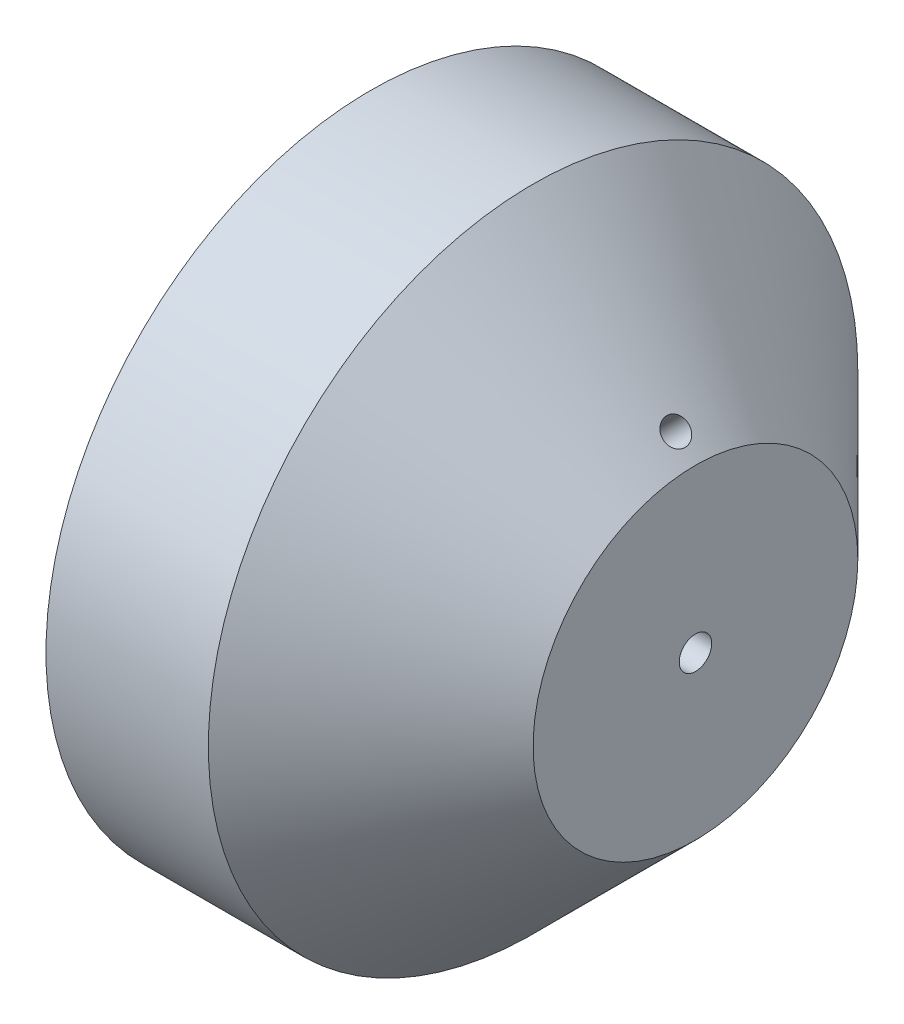
ISO-10303-21;
HEADER;
FILE_DESCRIPTION(('STEP AP214'),'2;1');
FILE_NAME('part.step','',(''),(''),'','','');
FILE_SCHEMA(('AUTOMOTIVE_DESIGN { 1 0 10303 214 1 1 1 1 }'));
ENDSEC;
DATA;
#1=APPLICATION_CONTEXT('core data for automotive mechanical design processes');
#2=APPLICATION_PROTOCOL_DEFINITION('international standard','automotive_design',2000,#1);
#3=PRODUCT_CONTEXT('',#1,'mechanical');
#4=PRODUCT('Part','Part','',(#3));
#5=PRODUCT_RELATED_PRODUCT_CATEGORY('part','',(#4));
#6=PRODUCT_DEFINITION_FORMATION('','',#4);
#7=PRODUCT_DEFINITION_CONTEXT('part definition',#1,'design');
#8=PRODUCT_DEFINITION('design','',#6,#7);
#9=PRODUCT_DEFINITION_SHAPE('','',#8);
#10=(LENGTH_UNIT() NAMED_UNIT(*) SI_UNIT(.MILLI.,.METRE.));
#11=(NAMED_UNIT(*) PLANE_ANGLE_UNIT() SI_UNIT($,.RADIAN.));
#12=(NAMED_UNIT(*) SI_UNIT($,.STERADIAN.) SOLID_ANGLE_UNIT());
#13=UNCERTAINTY_MEASURE_WITH_UNIT(LENGTH_MEASURE(1.E-05),#10,'distance_accuracy_value','');
#14=(GEOMETRIC_REPRESENTATION_CONTEXT(3) GLOBAL_UNCERTAINTY_ASSIGNED_CONTEXT((#13)) GLOBAL_UNIT_ASSIGNED_CONTEXT((#10,
#11,#12)) REPRESENTATION_CONTEXT('',''));
#15=CARTESIAN_POINT('',(0.,0.,0.));
#16=DIRECTION('',(0.,0.,1.));
#17=DIRECTION('',(1.,0.,0.));
#18=AXIS2_PLACEMENT_3D('',#15,#16,#17);
#19=CARTESIAN_POINT('',(50.,0.,0.));
#20=DIRECTION('',(1.,0.,0.));
#21=DIRECTION('',(0.,0.,-1.));
#22=AXIS2_PLACEMENT_3D('',#19,#20,#21);
#23=PLANE('',#22);
#24=CARTESIAN_POINT('',(50.,0.,0.));
#25=DIRECTION('',(1.,0.,0.));
#26=DIRECTION('',(0.,0.,-1.));
#27=AXIS2_PLACEMENT_3D('',#24,#25,#26);
#28=CIRCLE('',#27,25.);
#29=CARTESIAN_POINT('',(50.,0.,-25.));
#30=VERTEX_POINT('',#29);
#31=EDGE_CURVE('E41',#30,#30,#28,.T.);
#32=ORIENTED_EDGE('',*,*,#31,.T.);
#33=EDGE_LOOP('',(#32));
#34=FACE_BOUND('',#33,.T.);
#35=CARTESIAN_POINT('',(50.,0.,0.));
#36=DIRECTION('',(1.,0.,0.));
#37=DIRECTION('',(0.,0.,-1.));
#38=AXIS2_PLACEMENT_3D('',#35,#36,#37);
#39=CIRCLE('',#38,2.5);
#40=CARTESIAN_POINT('',(50.,0.,-2.5));
#41=VERTEX_POINT('',#40);
#42=EDGE_CURVE('E49',#41,#41,#39,.T.);
#43=ORIENTED_EDGE('',*,*,#42,.F.);
#44=EDGE_LOOP('',(#43));
#45=FACE_BOUND('',#44,.T.);
#46=ADVANCED_FACE('F33',(#34,#45),#23,.T.);
#47=CARTESIAN_POINT('',(0.,0.,0.));
#48=DIRECTION('',(1.,0.,0.));
#49=DIRECTION('',(0.,0.,-1.));
#50=AXIS2_PLACEMENT_3D('',#47,#48,#49);
#51=PLANE('',#50);
#52=CARTESIAN_POINT('',(0.,0.,0.));
#53=DIRECTION('',(1.,0.,0.));
#54=DIRECTION('',(0.,0.,-1.));
#55=AXIS2_PLACEMENT_3D('',#52,#53,#54);
#56=CIRCLE('',#55,50.);
#57=CARTESIAN_POINT('',(0.,0.,-50.));
#58=VERTEX_POINT('',#57);
#59=EDGE_CURVE('E45',#58,#58,#56,.T.);
#60=ORIENTED_EDGE('',*,*,#59,.F.);
#61=EDGE_LOOP('',(#60));
#62=FACE_BOUND('',#61,.T.);
#63=CARTESIAN_POINT('',(0.,0.,0.));
#64=DIRECTION('',(1.,0.,0.));
#65=DIRECTION('',(0.,0.,-1.));
#66=AXIS2_PLACEMENT_3D('',#63,#64,#65);
#67=CIRCLE('',#66,2.5);
#68=CARTESIAN_POINT('',(0.,0.,-2.5));
#69=VERTEX_POINT('',#68);
#70=EDGE_CURVE('E52',#69,#69,#67,.T.);
#71=ORIENTED_EDGE('',*,*,#70,.T.);
#72=EDGE_LOOP('',(#71));
#73=FACE_BOUND('',#72,.T.);
#74=ADVANCED_FACE('F81',(#62,#73),#51,.F.);
#75=CARTESIAN_POINT('',(50.,0.,0.));
#76=DIRECTION('',(-1.,0.,0.));
#77=DIRECTION('',(0.,0.,1.));
#78=AXIS2_PLACEMENT_3D('',#75,#76,#77);
#79=CYLINDRICAL_SURFACE('',#78,50.);
#80=CARTESIAN_POINT('',(24.9999999999999,0.,0.));
#81=DIRECTION('',(1.,0.,0.));
#82=DIRECTION('',(0.,0.,-1.));
#83=AXIS2_PLACEMENT_3D('',#80,#81,#82);
#84=CIRCLE('',#83,50.);
#85=CARTESIAN_POINT('',(24.9999999999999,0.,-50.));
#86=VERTEX_POINT('',#85);
#87=EDGE_CURVE('E10',#86,#86,#84,.F.);
#88=ORIENTED_EDGE('',*,*,#87,.T.);
#89=EDGE_LOOP('',(#88));
#90=FACE_BOUND('',#89,.T.);
#91=ORIENTED_EDGE('',*,*,#59,.T.);
#92=EDGE_LOOP('',(#91));
#93=FACE_BOUND('',#92,.T.);
#94=ADVANCED_FACE('F77',(#90,#93),#79,.T.);
#95=CARTESIAN_POINT('',(50.,0.,0.));
#96=DIRECTION('',(-1.,0.,0.));
#97=DIRECTION('',(0.,0.,1.));
#98=AXIS2_PLACEMENT_3D('',#95,#96,#97);
#99=CYLINDRICAL_SURFACE('',#98,2.5);
#100=CARTESIAN_POINT('',(18.6715728752539,2.5,0.));
#101=CARTESIAN_POINT('',(18.6715729852198,2.49999910620176,-0.112217874982996));
#102=CARTESIAN_POINT('',(18.6773695124204,2.4924057506618,-0.224442316169118));
#103=CARTESIAN_POINT('',(18.7006145043815,2.4624854634382,-0.445671895270164));
#104=CARTESIAN_POINT('',(18.7180632667803,2.44015815539866,-0.554676950876583));
#105=CARTESIAN_POINT('',(18.7648073203438,2.38218271165186,-0.766318339310366));
#106=CARTESIAN_POINT('',(18.7940947253896,2.34654344468717,-0.868958859375312));
#107=CARTESIAN_POINT('',(18.865111978812,2.26417726386747,-1.06527341916253));
#108=CARTESIAN_POINT('',(18.9068515584717,2.21744168417835,-1.15894037019191));
#109=CARTESIAN_POINT('',(18.9795996756065,2.14164361409988,-1.29072529777979));
#110=CARTESIAN_POINT('',(19.0056158045066,2.11535638618593,-1.33329537245481));
#111=CARTESIAN_POINT('',(19.0612273572769,2.06149412883328,-1.41514414547934));
#112=CARTESIAN_POINT('',(19.090820976959,2.03391975279644,-1.45442448611599));
#113=CARTESIAN_POINT('',(19.1537563956422,1.97821946940819,-1.52932129115491));
#114=CARTESIAN_POINT('',(19.1870929597328,1.95009437667661,-1.56494274253114));
#115=CARTESIAN_POINT('',(19.2577087405249,1.8941244531398,-1.6322406408421));
#116=CARTESIAN_POINT('',(19.2949862458869,1.86627950638829,-1.66391878723589));
#117=CARTESIAN_POINT('',(19.3916132036456,1.79938918863572,-1.73655196244185));
#118=CARTESIAN_POINT('',(19.4532716293391,1.76103174394861,-1.77514282685048));
#119=CARTESIAN_POINT('',(19.5847348046492,1.69038434078776,-1.84255353113427));
#120=CARTESIAN_POINT('',(19.6545255087487,1.65808416524396,-1.87138989165038));
#121=CARTESIAN_POINT('',(19.8005897034885,1.6021712936295,-1.91948525142725));
#122=CARTESIAN_POINT('',(19.8768646698455,1.57856058169566,-1.93874206366342));
#123=CARTESIAN_POINT('',(20.0333542371363,1.54091955334789,-1.96879471800065));
#124=CARTESIAN_POINT('',(20.1135735072139,1.52690089935687,-1.97958026272921));
#125=CARTESIAN_POINT('',(20.2573354975357,1.50978027877301,-1.99264613882588));
#126=CARTESIAN_POINT('',(20.3205746199076,1.50493300686236,-1.99629313054019));
#127=CARTESIAN_POINT('',(20.4473643921055,1.49973335053177,-2.00020284501765));
#128=CARTESIAN_POINT('',(20.5109152204313,1.49938394350907,-2.0004633260544));
#129=CARTESIAN_POINT('',(20.6380795291167,1.50242091191305,-1.9981823940306));
#130=CARTESIAN_POINT('',(20.7016924223079,1.50582063701549,-1.99563096852875));
#131=CARTESIAN_POINT('',(20.8285550690893,1.51567169437341,-1.98815919830329));
#132=CARTESIAN_POINT('',(20.8918046516897,1.52212436062354,-1.98323781800182));
#133=CARTESIAN_POINT('',(21.0245666288708,1.53831547642921,-1.97071071428006));
#134=CARTESIAN_POINT('',(21.0940223903567,1.5483323087853,-1.96287352818916));
#135=CARTESIAN_POINT('',(21.2322664668146,1.57074991689821,-1.94498087968932));
#136=CARTESIAN_POINT('',(21.30105460157,1.58315131851316,-1.93492483481246));
#137=CARTESIAN_POINT('',(21.5065078435099,1.62318404989418,-1.90170274432623));
#138=CARTESIAN_POINT('',(21.6421399246476,1.6536271597816,-1.87549499504389));
#139=CARTESIAN_POINT('',(21.9106230723296,1.71921088030814,-1.81557037504495));
#140=CARTESIAN_POINT('',(22.0434722033744,1.75435464241811,-1.78184845639429));
#141=CARTESIAN_POINT('',(22.3060689592215,1.82753641595637,-1.70671234246773));
#142=CARTESIAN_POINT('',(22.43581885867,1.86557221331603,-1.66530399740568));
#143=CARTESIAN_POINT('',(22.6449600622586,1.92904226157059,-1.59067268134472));
#144=CARTESIAN_POINT('',(22.7254118098484,1.95399696279253,-1.55999581206697));
#145=CARTESIAN_POINT('',(22.8846523413595,2.00426429531689,-1.49486389249162));
#146=CARTESIAN_POINT('',(22.9634413844791,2.02957686978774,-1.46040943634667));
#147=CARTESIAN_POINT('',(23.1189000915854,2.08023025322842,-1.38730638671625));
#148=CARTESIAN_POINT('',(23.1955726947919,2.10557096632225,-1.34866401938702));
#149=CARTESIAN_POINT('',(23.3463440489702,2.15597601349175,-1.26652571514012));
#150=CARTESIAN_POINT('',(23.4204437991663,2.18104045222385,-1.22303169075478));
#151=CARTESIAN_POINT('',(23.5824142634041,2.2363417206295,-1.11938080809667));
#152=CARTESIAN_POINT('',(23.6693962677729,2.26639960348735,-1.05771608781615));
#153=CARTESIAN_POINT('',(23.8355096597184,2.324313411072,-0.92353452326624));
#154=CARTESIAN_POINT('',(23.9146513682677,2.35217222056769,-0.85103226986096));
#155=CARTESIAN_POINT('',(24.033141945174,2.39415124081977,-0.721663612907927));
#156=CARTESIAN_POINT('',(24.0764209115705,2.40955597806843,-0.668853540876669));
#157=CARTESIAN_POINT('',(24.1554829180666,2.43778791735781,-0.557220350534155));
#158=CARTESIAN_POINT('',(24.1912780852801,2.45061928801042,-0.498407193766607));
#159=CARTESIAN_POINT('',(24.2451437296219,2.46997010672182,-0.389297168522678));
#160=CARTESIAN_POINT('',(24.265402052393,2.47726403467774,-0.340233165347108));
#161=CARTESIAN_POINT('',(24.2980876908638,2.48904438923752,-0.239232676471039));
#162=CARTESIAN_POINT('',(24.310524668519,2.49353427971004,-0.187299821415684));
#163=CARTESIAN_POINT('',(24.3263173723756,2.49923714856026,-0.0814631252600488));
#164=CARTESIAN_POINT('',(24.3296064179259,2.50042606553689,-0.0275476995489273));
#165=CARTESIAN_POINT('',(24.3264872531397,2.49929913860011,0.0799679590337797));
#166=CARTESIAN_POINT('',(24.3200774184099,2.496982707602,0.133568137597531));
#167=CARTESIAN_POINT('',(24.2994669501081,2.48954369137656,0.233284446160711));
#168=CARTESIAN_POINT('',(24.2861227621662,2.48472966690459,0.279608137637888));
#169=CARTESIAN_POINT('',(24.2533546678231,2.47292712187363,0.369729345521623));
#170=CARTESIAN_POINT('',(24.2339282579169,2.46593770590823,0.413525812889621));
#171=CARTESIAN_POINT('',(24.1757791830027,2.4450593911815,0.526110025821467));
#172=CARTESIAN_POINT('',(24.1327685557597,2.42965607863452,0.592389964045537));
#173=CARTESIAN_POINT('',(24.0377257960893,2.39577937442987,0.717256109681627));
#174=CARTESIAN_POINT('',(23.985665444644,2.37729638738198,0.775817212716754));
#175=CARTESIAN_POINT('',(23.8797059597909,2.3398938167987,0.881933654867396));
#176=CARTESIAN_POINT('',(23.8262476075537,2.32111428322279,0.929987254922459));
#177=CARTESIAN_POINT('',(23.7155864776175,2.2824818273206,1.02114135817597));
#178=CARTESIAN_POINT('',(23.6583803502957,2.26262794761871,1.06423733296822));
#179=CARTESIAN_POINT('',(23.5410710733749,2.22221136611151,1.14624142348517));
#180=CARTESIAN_POINT('',(23.4809608460129,2.20164697137551,1.18513847439096));
#181=CARTESIAN_POINT('',(23.3585937744594,2.16014121023792,1.25920271714761));
#182=CARTESIAN_POINT('',(23.2963361222385,2.1391997033855,1.29436848425512));
#183=CARTESIAN_POINT('',(23.1656097467753,2.09566705895954,1.36380975284362));
#184=CARTESIAN_POINT('',(23.0970155067112,2.07306517982304,1.39784116994276));
#185=CARTESIAN_POINT('',(22.9582401034921,2.02792393828065,1.46255884636553));
#186=CARTESIAN_POINT('',(22.8880585965782,2.00538459062727,1.49324437251925));
#187=CARTESIAN_POINT('',(22.6753898061637,1.93812683257915,1.58085580768777));
#188=CARTESIAN_POINT('',(22.5309024512607,1.8938104932771,1.63327248151843));
#189=CARTESIAN_POINT('',(22.2380671184855,1.80803165832617,1.72773402782169));
#190=CARTESIAN_POINT('',(22.0897252124932,1.76656500961374,1.76979423499253));
#191=CARTESIAN_POINT('',(21.7894948376751,1.68858459894567,1.84433653300351));
#192=CARTESIAN_POINT('',(21.6376101028793,1.65206587601636,1.87682825650868));
#193=CARTESIAN_POINT('',(21.3630111872375,1.59424195656941,1.92600857438662));
#194=CARTESIAN_POINT('',(21.2409718972606,1.5713530715456,1.94458897230519));
#195=CARTESIAN_POINT('',(20.9944789294882,1.53336553144323,1.97468678051486));
#196=CARTESIAN_POINT('',(20.870021878059,1.51827871550809,1.98619346185516));
#197=CARTESIAN_POINT('',(20.6812773826363,1.50462653174253,1.99652932188791));
#198=CARTESIAN_POINT('',(20.6175082621599,1.50158471574189,1.99881037405891));
#199=CARTESIAN_POINT('',(20.4898267196916,1.49935840589083,2.00048211224141));
#200=CARTESIAN_POINT('',(20.4259142732704,1.50017462900585,1.99987226101676));
#201=CARTESIAN_POINT('',(20.2987161139306,1.50644452301583,1.99515480415733));
#202=CARTESIAN_POINT('',(20.2354288662741,1.51187619841076,1.99106378830622));
#203=CARTESIAN_POINT('',(20.1099872652512,1.52805386810442,1.97867489381235));
#204=CARTESIAN_POINT('',(20.047831928711,1.53879499755052,1.97038086605624));
#205=CARTESIAN_POINT('',(19.9079711509556,1.56997753030126,1.94568412895409));
#206=CARTESIAN_POINT('',(19.8309506057597,1.59232306993478,1.92763276013903));
#207=CARTESIAN_POINT('',(19.6830809026983,1.64596936046499,1.8820210483037));
#208=CARTESIAN_POINT('',(19.6122310214958,1.67726905989007,1.85446182169663));
#209=CARTESIAN_POINT('',(19.478790853791,1.74620323424261,1.78968932094235));
#210=CARTESIAN_POINT('',(19.4161811170123,1.78382229647844,1.75249941892871));
#211=CARTESIAN_POINT('',(19.2995373708861,1.86216826430934,1.66901381760989));
#212=CARTESIAN_POINT('',(19.2455137989043,1.90289886462373,1.62270718669527));
#213=CARTESIAN_POINT('',(19.1422145908918,1.98729744634271,1.51837435624926));
#214=CARTESIAN_POINT('',(19.093551385904,2.03096797083633,1.45974826263636));
#215=CARTESIAN_POINT('',(19.0049757042826,2.11543311181938,1.33441674269401));
#216=CARTESIAN_POINT('',(18.9650655115827,2.15622697581899,1.26770921469856));
#217=CARTESIAN_POINT('',(18.8861856199751,2.24036220612233,1.11351902589102));
#218=CARTESIAN_POINT('',(18.8489643467706,2.28261067069619,1.02453727278643));
#219=CARTESIAN_POINT('',(18.7852941644605,2.35718436089094,0.838874136568478));
#220=CARTESIAN_POINT('',(18.7588497571196,2.38950543820952,0.742189555911897));
#221=CARTESIAN_POINT('',(18.715506133772,2.44341183605552,0.539577208240975));
#222=CARTESIAN_POINT('',(18.6990184885661,2.46453034508268,0.433436148769593));
#223=CARTESIAN_POINT('',(18.6770517094519,2.49282498363714,0.218198829575444));
#224=CARTESIAN_POINT('',(18.6715727683409,2.50000086898489,0.109102518130771));
#225=CARTESIAN_POINT('',(18.6715728752539,2.5,0.));
#226=B_SPLINE_CURVE_WITH_KNOTS('',3,(#100,#101,#102,#103,#104,#105,#106,#107,#108,#109,#110,
#111,#112,#113,#114,#115,#116,#117,#118,#119,#120,#121,#122,#123,#124,#125,#126,#127,#128,#129,
#130,#131,#132,#133,#134,#135,#136,#137,#138,#139,#140,#141,#142,#143,#144,#145,#146,#147,#148,
#149,#150,#151,#152,#153,#154,#155,#156,#157,#158,#159,#160,#161,#162,#163,#164,#165,#166,#167,
#168,#169,#170,#171,#172,#173,#174,#175,#176,#177,#178,#179,#180,#181,#182,#183,#184,#185,#186,
#187,#188,#189,#190,#191,#192,#193,#194,#195,#196,#197,#198,#199,#200,#201,#202,#203,#204,#205,
#206,#207,#208,#209,#210,#211,#212,#213,#214,#215,#216,#217,#218,#219,#220,#221,#222,#223,#224,
#225),.UNSPECIFIED.,.T.,.F.,(4,2,2,2,2,2,2,2,2,2,2,2,2,2,2,2,2,2,2,2,2,2,2,2,2,2,2,2,2,2,2,2,2,
2,2,2,2,2,2,2,2,2,2,2,2,2,2,2,2,2,2,2,2,2,2,2,2,2,2,2,2,2,4),(0.,0.33626541663256,
0.672539422974656,1.00858979404355,1.34490347705001,1.51389787915749,1.6828074073692,
1.85148357295149,2.02008679006255,2.26563661108533,2.5107684516136,2.75595623043793,
3.00144159154985,3.19175954478702,3.38220347402508,3.57332772006078,3.76453555582443,
3.97627102516894,4.1880621430101,4.61201404196567,5.03625161029164,5.46016760145825,
5.72902517433175,5.99784052080482,6.26626156475119,6.53457716807584,6.8663617278154,
7.19770355459366,7.40718382269414,7.61632196172848,7.77646347431441,7.93640676839392,
8.0975128955116,8.25864600808368,8.40343042217539,8.54827450953655,8.78838061800223,
9.02924931896377,9.25180377147017,9.47455992261574,9.69788943487537,9.92130391810042,
10.1607172136607,10.4001828657874,10.8795503537826,11.3582037210316,11.8363735640174,
12.2127287646337,12.5896533968453,12.7811601650258,12.9727025236001,13.1633371503949,
13.3537974287392,13.5991846072142,13.8445429821139,14.0893114018448,14.33437512382,
14.5968974024297,14.8594880999986,15.1740336159082,15.4887103909532,15.8156347889133,
16.1425649123047),.UNSPECIFIED.);
#227=CARTESIAN_POINT('',(18.6715728752539,2.5,0.));
#228=VERTEX_POINT('',#227);
#229=EDGE_CURVE('E63',#228,#228,#226,.T.);
#230=ORIENTED_EDGE('',*,*,#229,.F.);
#231=EDGE_LOOP('',(#230));
#232=FACE_BOUND('',#231,.T.);
#233=ORIENTED_EDGE('',*,*,#42,.T.);
#234=EDGE_LOOP('',(#233));
#235=FACE_BOUND('',#234,.T.);
#236=ORIENTED_EDGE('',*,*,#70,.F.);
#237=EDGE_LOOP('',(#236));
#238=FACE_BOUND('',#237,.T.);
#239=ADVANCED_FACE('F74',(#232,#235,#238),#99,.F.);
#240=CARTESIAN_POINT('',(50.,0.,0.));
#241=DIRECTION('',(-1.,0.,0.));
#242=DIRECTION('',(0.,0.,1.));
#243=AXIS2_PLACEMENT_3D('',#240,#241,#242);
#244=CONICAL_SURFACE('',#243,25.,0.785398163397446);
#245=CARTESIAN_POINT('',(47.9218448578936,27.0370614195534,-1.49123965051871));
#246=CARTESIAN_POINT('',(47.8606219959023,27.0942505827819,-1.56606379057812));
#247=CARTESIAN_POINT('',(47.7949449927816,27.1560037957343,-1.63387478749336));
#248=CARTESIAN_POINT('',(47.6567254339215,27.2870503551285,-1.75347138619804));
#249=CARTESIAN_POINT('',(47.5841749350782,27.3563524393367,-1.80523814469528));
#250=CARTESIAN_POINT('',(47.4344722991524,27.5006034252581,-1.89118515603488));
#251=CARTESIAN_POINT('',(47.3573220925415,27.5755499614542,-1.92537272958329));
#252=CARTESIAN_POINT('',(47.2006979597555,27.729049057665,-1.97520003049085));
#253=CARTESIAN_POINT('',(47.121224613266,27.8076007208459,-1.99084434508584));
#254=CARTESIAN_POINT('',(46.962284719915,27.9660662701782,-2.00315100662039));
#255=CARTESIAN_POINT('',(46.8828182123765,28.0459790941832,-1.9998275337569));
#256=CARTESIAN_POINT('',(46.7260597074815,28.2049297995506,-1.9743262270239));
#257=CARTESIAN_POINT('',(46.6487677929974,28.2839676474989,-1.9521476756024));
#258=CARTESIAN_POINT('',(46.4984858173483,28.4388315070757,-1.88957434964976));
#259=CARTESIAN_POINT('',(46.4254950967496,28.5146580105445,-1.84918237575178));
#260=CARTESIAN_POINT('',(46.2857460198145,28.6608453865464,-1.75133226890506));
#261=CARTESIAN_POINT('',(46.2189876932974,28.7312062329284,-1.69387405430748));
#262=CARTESIAN_POINT('',(46.0933742543316,28.8643961861869,-1.56345092440797));
#263=CARTESIAN_POINT('',(46.0345275093021,28.9272173115146,-1.49046979913466));
#264=CARTESIAN_POINT('',(45.9263247427255,29.0433044750615,-1.33110336345696));
#265=CARTESIAN_POINT('',(45.8769687437834,29.0965704905223,-1.24471802112747));
#266=CARTESIAN_POINT('',(45.7889642010258,29.1919135210335,-1.06092957170291));
#267=CARTESIAN_POINT('',(45.7503223094233,29.2339835840529,-0.963519672252916));
#268=CARTESIAN_POINT('',(45.68475300712,29.3055603420422,-0.760487319337207));
#269=CARTESIAN_POINT('',(45.6578255565566,29.3350670797635,-0.654864893819062));
#270=CARTESIAN_POINT('',(45.6163687720047,29.380559853476,-0.438481167694881));
#271=CARTESIAN_POINT('',(45.6018310428343,29.3965550447247,-0.32772340049862));
#272=CARTESIAN_POINT('',(45.5854831053106,29.4145451120009,-0.104150961843163));
#273=CARTESIAN_POINT('',(45.5836728126043,29.4165400808171,0.00866369597870854));
#274=CARTESIAN_POINT('',(45.5928200805477,29.4064704603041,0.233037020002215));
#275=CARTESIAN_POINT('',(45.6037658661883,29.3944188372428,0.344596748702767));
#276=CARTESIAN_POINT('',(45.6381352390654,29.356663936203,0.563400318158455));
#277=CARTESIAN_POINT('',(45.6615588418679,29.3309606411943,0.670644153529364));
#278=CARTESIAN_POINT('',(45.7203093638722,29.2667159653888,0.877797438315729));
#279=CARTESIAN_POINT('',(45.7556385862371,29.2281721005778,0.977705464047947));
#280=CARTESIAN_POINT('',(45.8373202294395,29.1394665681386,1.16733909271323));
#281=CARTESIAN_POINT('',(45.8836727268108,29.0893048198482,1.2570646249434));
#282=CARTESIAN_POINT('',(45.9862910016565,28.9788760589423,1.42388416093688));
#283=CARTESIAN_POINT('',(46.0425669097172,28.9185987226177,1.50096509939389));
#284=CARTESIAN_POINT('',(46.1635666350425,28.7898415264706,1.64020090615364));
#285=CARTESIAN_POINT('',(46.2282904741819,28.7213616454087,1.70235573580584));
#286=CARTESIAN_POINT('',(46.3645310799611,28.5782678627504,1.80999324334908));
#287=CARTESIAN_POINT('',(46.4360501198004,28.5036519095834,1.85547031712711));
#288=CARTESIAN_POINT('',(46.5839649361006,28.3505547390548,1.92842590245513));
#289=CARTESIAN_POINT('',(46.6603606809329,28.2720735467625,1.95590453072376));
#290=CARTESIAN_POINT('',(46.8158789933205,28.1136432229326,1.9920602255799));
#291=CARTESIAN_POINT('',(46.8949990012761,28.033695500601,2.00075447649222));
#292=CARTESIAN_POINT('',(47.0538255315935,27.874578425923,1.99914275020796));
#293=CARTESIAN_POINT('',(47.1335320507159,27.7954090692833,1.98883687787037));
#294=CARTESIAN_POINT('',(47.2911853398848,27.6401504012039,1.94953630315087));
#295=CARTESIAN_POINT('',(47.3691335162584,27.5640585866971,1.92055712701493));
#296=CARTESIAN_POINT('',(47.521057253056,27.4169701709899,1.84475165271087));
#297=CARTESIAN_POINT('',(47.5950328013805,27.3459735853078,1.79792530018896));
#298=CARTESIAN_POINT('',(47.7368357467768,27.2109218032405,1.68772556956999));
#299=CARTESIAN_POINT('',(47.8046596360604,27.1468705631987,1.62434282964604));
#300=CARTESIAN_POINT('',(47.9320338048148,27.0274024668405,1.48283923908341));
#301=CARTESIAN_POINT('',(47.9915840037282,26.9719856945936,1.40471824496213));
#302=CARTESIAN_POINT('',(48.1006068402246,26.8711130265358,1.23585140596726));
#303=CARTESIAN_POINT('',(48.1500681167778,26.8256683558894,1.14509151991255));
#304=CARTESIAN_POINT('',(48.2372445794809,26.7459268009064,0.953582416184875));
#305=CARTESIAN_POINT('',(48.2749597605183,26.7116299214219,0.85283319416407));
#306=CARTESIAN_POINT('',(48.3374085391717,26.6550081708927,0.644216336080226));
#307=CARTESIAN_POINT('',(48.3621440325062,26.6326815515487,0.536349742120722));
#308=CARTESIAN_POINT('',(48.3978214057622,26.6005208236091,0.316554134164984));
#309=CARTESIAN_POINT('',(48.408763936135,26.5906861259165,0.204625311992284));
#310=CARTESIAN_POINT('',(48.4164870397406,26.5837422384462,-0.0199582386427293));
#311=CARTESIAN_POINT('',(48.4132868919707,26.5866157251464,-0.132611770006492));
#312=CARTESIAN_POINT('',(48.3928711803307,26.6049855217107,-0.355625699559289));
#313=CARTESIAN_POINT('',(48.3756522457604,26.6204848673578,-0.465985539704099));
#314=CARTESIAN_POINT('',(48.3277700362007,26.6637438133847,-0.681259141489894));
#315=CARTESIAN_POINT('',(48.297104515901,26.6915054613287,-0.786171990319004));
#316=CARTESIAN_POINT('',(48.2233529996798,26.7586171962093,-0.987483066674021));
#317=CARTESIAN_POINT('',(48.1802814962843,26.7979537626113,-1.08389105879873));
#318=CARTESIAN_POINT('',(48.1008978961865,26.870917529325,-1.2323487384009));
#319=CARTESIAN_POINT('',(48.0678508417486,26.9013936037339,-1.28775154826894));
#320=CARTESIAN_POINT('',(47.9977486287958,26.9663210225908,-1.39345739870543));
#321=CARTESIAN_POINT('',(47.9606934649321,27.0007723723436,-1.44376043246819));
#322=CARTESIAN_POINT('',(47.9218448578936,27.0370614195534,-1.49123965051871));
#323=B_SPLINE_CURVE_WITH_KNOTS('',3,(#245,#246,#247,#248,#249,#250,#251,#252,#253,#254,#255,
#256,#257,#258,#259,#260,#261,#262,#263,#264,#265,#266,#267,#268,#269,#270,#271,#272,#273,#274,
#275,#276,#277,#278,#279,#280,#281,#282,#283,#284,#285,#286,#287,#288,#289,#290,#291,#292,#293,
#294,#295,#296,#297,#298,#299,#300,#301,#302,#303,#304,#305,#306,#307,#308,#309,#310,#311,#312,
#313,#314,#315,#316,#317,#318,#319,#320,#321,#322),.UNSPECIFIED.,.T.,.F.,(4,2,2,2,2,2,2,2,2,2,2,
2,2,2,2,2,2,2,2,2,2,2,2,2,2,2,2,2,2,2,2,2,2,2,2,2,2,2,4),(0.,0.336723224382538,
0.673840430613589,1.01081713324303,1.34771045708537,1.68435195463446,2.02100626404192,
2.35760882458823,2.69421299554529,3.0311704101854,3.36812862737604,3.70529559026366,
4.0424614058083,4.37939857827807,4.71633351764313,5.0529576819139,5.38958226612205,
5.72627200836825,6.0629640883013,6.4000019008331,6.73704058610113,7.07419242064323,
7.41134206875802,7.74818315479224,8.08502238185353,8.42158189879206,8.75814244073492,
9.09489370471615,9.43164824727022,9.76877993714749,10.1059117737612,10.4429943576432,
10.7800610447186,11.1166683915077,11.4533566966355,11.7901012433827,12.1264539935167,
12.3401194502203,12.5537851920576),.UNSPECIFIED.);
#324=CARTESIAN_POINT('',(47.9218448578936,27.0370614195534,-1.49123965051871));
#325=VERTEX_POINT('',#324);
#326=EDGE_CURVE('E55',#325,#325,#323,.T.);
#327=ORIENTED_EDGE('',*,*,#326,.F.);
#328=EDGE_LOOP('',(#327));
#329=FACE_BOUND('',#328,.T.);
#330=ORIENTED_EDGE('',*,*,#87,.F.);
#331=EDGE_LOOP('',(#330));
#332=FACE_BOUND('',#331,.T.);
#333=ORIENTED_EDGE('',*,*,#31,.F.);
#334=EDGE_LOOP('',(#333));
#335=FACE_BOUND('',#334,.T.);
#336=ADVANCED_FACE('F35',(#329,#332,#335),#244,.T.);
#337=CARTESIAN_POINT('',(47.,28.,0.));
#338=DIRECTION('',(0.707106781186546,0.707106781186549,0.));
#339=DIRECTION('',(-0.707106781186549,0.707106781186546,0.));
#340=AXIS2_PLACEMENT_3D('',#337,#338,#339);
#341=CYLINDRICAL_SURFACE('',#340,1.99999999999999);
#342=ORIENTED_EDGE('',*,*,#326,.T.);
#343=EDGE_LOOP('',(#342));
#344=FACE_BOUND('',#343,.T.);
#345=ORIENTED_EDGE('',*,*,#229,.T.);
#346=EDGE_LOOP('',(#345));
#347=FACE_BOUND('',#346,.T.);
#348=ADVANCED_FACE('F67',(#344,#347),#341,.F.);
#349=CLOSED_SHELL('',(#46,#74,#94,#239,#336,#348));
#350=MANIFOLD_SOLID_BREP('B2',#349);
#351=ADVANCED_BREP_SHAPE_REPRESENTATION('',(#18,#350),#14);
#352=SHAPE_DEFINITION_REPRESENTATION(#9,#351);
ENDSEC;
END-ISO-10303-21;
